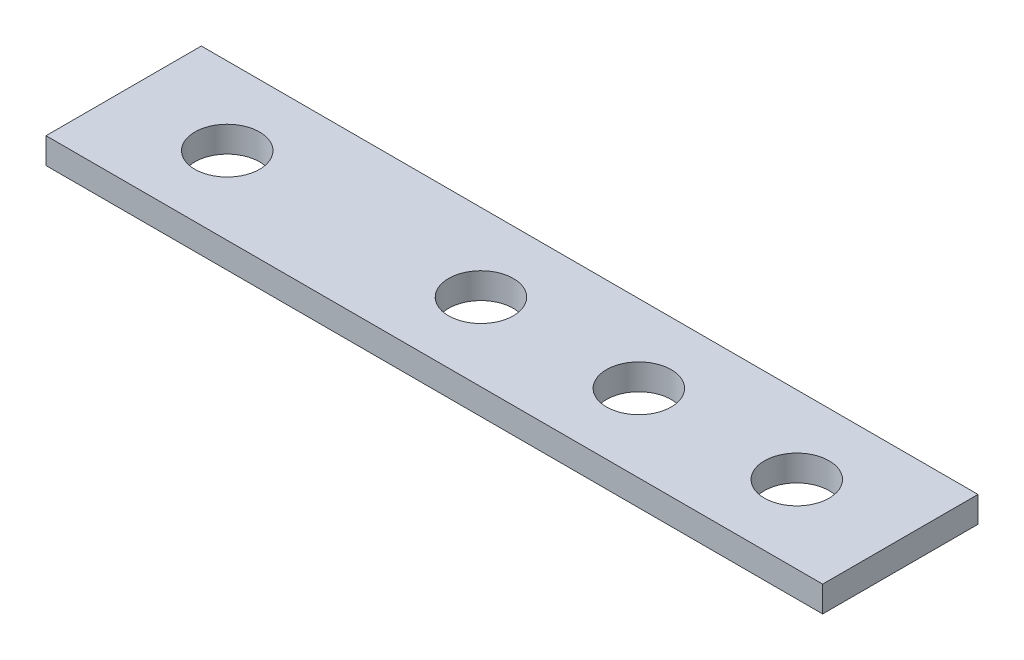
ISO-10303-21;
HEADER;
FILE_DESCRIPTION(('STEP AP214'),'2;1');
FILE_NAME('part.step','',(''),(''),'','','');
FILE_SCHEMA(('AUTOMOTIVE_DESIGN { 1 0 10303 214 1 1 1 1 }'));
ENDSEC;
DATA;
#1=APPLICATION_CONTEXT('core data for automotive mechanical design processes');
#2=APPLICATION_PROTOCOL_DEFINITION('international standard','automotive_design',2000,#1);
#3=PRODUCT_CONTEXT('',#1,'mechanical');
#4=PRODUCT('Part','Part','',(#3));
#5=PRODUCT_RELATED_PRODUCT_CATEGORY('part','',(#4));
#6=PRODUCT_DEFINITION_FORMATION('','',#4);
#7=PRODUCT_DEFINITION_CONTEXT('part definition',#1,'design');
#8=PRODUCT_DEFINITION('design','',#6,#7);
#9=PRODUCT_DEFINITION_SHAPE('','',#8);
#10=(LENGTH_UNIT() NAMED_UNIT(*) SI_UNIT(.MILLI.,.METRE.));
#11=(NAMED_UNIT(*) PLANE_ANGLE_UNIT() SI_UNIT($,.RADIAN.));
#12=(NAMED_UNIT(*) SI_UNIT($,.STERADIAN.) SOLID_ANGLE_UNIT());
#13=UNCERTAINTY_MEASURE_WITH_UNIT(LENGTH_MEASURE(1.E-05),#10,'distance_accuracy_value','');
#14=(GEOMETRIC_REPRESENTATION_CONTEXT(3) GLOBAL_UNCERTAINTY_ASSIGNED_CONTEXT((#13)) GLOBAL_UNIT_ASSIGNED_CONTEXT((#10,
#11,#12)) REPRESENTATION_CONTEXT('',''));
#15=CARTESIAN_POINT('',(0.,0.,0.));
#16=DIRECTION('',(0.,0.,1.));
#17=DIRECTION('',(1.,0.,0.));
#18=AXIS2_PLACEMENT_3D('',#15,#16,#17);
#19=CARTESIAN_POINT('',(30.,2.,6.));
#20=DIRECTION('',(-1.,0.,0.));
#21=DIRECTION('',(0.,0.,1.));
#22=AXIS2_PLACEMENT_3D('',#19,#20,#21);
#23=PLANE('',#22);
#24=DIRECTION('',(0.,0.,-1.));
#25=VECTOR('',#24,1.);
#26=CARTESIAN_POINT('',(30.,0.,6.));
#27=LINE('',#26,#25);
#28=CARTESIAN_POINT('',(30.,0.,6.));
#29=VERTEX_POINT('',#28);
#30=CARTESIAN_POINT('',(30.,0.,-6.));
#31=VERTEX_POINT('',#30);
#32=EDGE_CURVE('E96',#29,#31,#27,.T.);
#33=ORIENTED_EDGE('',*,*,#32,.T.);
#34=DIRECTION('',(0.,-1.,0.));
#35=VECTOR('',#34,1.);
#36=CARTESIAN_POINT('',(30.,2.,-6.));
#37=LINE('',#36,#35);
#38=CARTESIAN_POINT('',(30.,2.,-6.));
#39=VERTEX_POINT('',#38);
#40=EDGE_CURVE('E11',#39,#31,#37,.T.);
#41=ORIENTED_EDGE('',*,*,#40,.F.);
#42=DIRECTION('',(0.,0.,-1.));
#43=VECTOR('',#42,1.);
#44=CARTESIAN_POINT('',(30.,2.,6.));
#45=LINE('',#44,#43);
#46=CARTESIAN_POINT('',(30.,2.,6.));
#47=VERTEX_POINT('',#46);
#48=EDGE_CURVE('E84',#47,#39,#45,.T.);
#49=ORIENTED_EDGE('',*,*,#48,.F.);
#50=DIRECTION('',(0.,-1.,0.));
#51=VECTOR('',#50,1.);
#52=CARTESIAN_POINT('',(30.,2.,6.));
#53=LINE('',#52,#51);
#54=EDGE_CURVE('E92',#47,#29,#53,.T.);
#55=ORIENTED_EDGE('',*,*,#54,.T.);
#56=EDGE_LOOP('',(#33,#41,#49,#55));
#57=FACE_BOUND('',#56,.T.);
#58=ADVANCED_FACE('F33',(#57),#23,.F.);
#59=CARTESIAN_POINT('',(-30.,2.,-6.));
#60=DIRECTION('',(0.,0.,1.));
#61=DIRECTION('',(1.,0.,0.));
#62=AXIS2_PLACEMENT_3D('',#59,#60,#61);
#63=PLANE('',#62);
#64=DIRECTION('',(-1.,0.,0.));
#65=VECTOR('',#64,1.);
#66=CARTESIAN_POINT('',(-30.,0.,-6.));
#67=LINE('',#66,#65);
#68=CARTESIAN_POINT('',(-30.,0.,-6.));
#69=VERTEX_POINT('',#68);
#70=EDGE_CURVE('E88',#31,#69,#67,.T.);
#71=ORIENTED_EDGE('',*,*,#70,.T.);
#72=DIRECTION('',(0.,-1.,0.));
#73=VECTOR('',#72,1.);
#74=CARTESIAN_POINT('',(-30.,2.,-6.));
#75=LINE('',#74,#73);
#76=CARTESIAN_POINT('',(-30.,2.,-6.));
#77=VERTEX_POINT('',#76);
#78=EDGE_CURVE('E41',#77,#69,#75,.T.);
#79=ORIENTED_EDGE('',*,*,#78,.F.);
#80=DIRECTION('',(-1.,0.,0.));
#81=VECTOR('',#80,1.);
#82=CARTESIAN_POINT('',(-30.,2.,-6.));
#83=LINE('',#82,#81);
#84=EDGE_CURVE('E79',#39,#77,#83,.T.);
#85=ORIENTED_EDGE('',*,*,#84,.F.);
#86=ORIENTED_EDGE('',*,*,#40,.T.);
#87=EDGE_LOOP('',(#71,#79,#85,#86));
#88=FACE_BOUND('',#87,.T.);
#89=ADVANCED_FACE('F87',(#88),#63,.F.);
#90=CARTESIAN_POINT('',(-30.,2.,6.));
#91=DIRECTION('',(1.,0.,0.));
#92=DIRECTION('',(0.,0.,-1.));
#93=AXIS2_PLACEMENT_3D('',#90,#91,#92);
#94=PLANE('',#93);
#95=DIRECTION('',(0.,0.,1.));
#96=VECTOR('',#95,1.);
#97=CARTESIAN_POINT('',(-30.,0.,6.));
#98=LINE('',#97,#96);
#99=CARTESIAN_POINT('',(-30.,0.,6.));
#100=VERTEX_POINT('',#99);
#101=EDGE_CURVE('E66',#69,#100,#98,.T.);
#102=ORIENTED_EDGE('',*,*,#101,.T.);
#103=DIRECTION('',(0.,-1.,0.));
#104=VECTOR('',#103,1.);
#105=CARTESIAN_POINT('',(-30.,2.,6.));
#106=LINE('',#105,#104);
#107=CARTESIAN_POINT('',(-30.,2.,6.));
#108=VERTEX_POINT('',#107);
#109=EDGE_CURVE('E89',#108,#100,#106,.T.);
#110=ORIENTED_EDGE('',*,*,#109,.F.);
#111=DIRECTION('',(0.,0.,1.));
#112=VECTOR('',#111,1.);
#113=CARTESIAN_POINT('',(-30.,2.,6.));
#114=LINE('',#113,#112);
#115=EDGE_CURVE('E82',#77,#108,#114,.T.);
#116=ORIENTED_EDGE('',*,*,#115,.F.);
#117=ORIENTED_EDGE('',*,*,#78,.T.);
#118=EDGE_LOOP('',(#102,#110,#116,#117));
#119=FACE_BOUND('',#118,.T.);
#120=ADVANCED_FACE('F90',(#119),#94,.F.);
#121=CARTESIAN_POINT('',(-30.,2.,6.));
#122=DIRECTION('',(0.,0.,-1.));
#123=DIRECTION('',(-1.,0.,0.));
#124=AXIS2_PLACEMENT_3D('',#121,#122,#123);
#125=PLANE('',#124);
#126=DIRECTION('',(1.,0.,0.));
#127=VECTOR('',#126,1.);
#128=CARTESIAN_POINT('',(-30.,0.,6.));
#129=LINE('',#128,#127);
#130=EDGE_CURVE('E72',#100,#29,#129,.T.);
#131=ORIENTED_EDGE('',*,*,#130,.T.);
#132=ORIENTED_EDGE('',*,*,#54,.F.);
#133=DIRECTION('',(1.,0.,0.));
#134=VECTOR('',#133,1.);
#135=CARTESIAN_POINT('',(-30.,2.,6.));
#136=LINE('',#135,#134);
#137=EDGE_CURVE('E49',#108,#47,#136,.T.);
#138=ORIENTED_EDGE('',*,*,#137,.F.);
#139=ORIENTED_EDGE('',*,*,#109,.T.);
#140=EDGE_LOOP('',(#131,#132,#138,#139));
#141=FACE_BOUND('',#140,.T.);
#142=ADVANCED_FACE('F104',(#141),#125,.F.);
#143=CARTESIAN_POINT('',(0.,2.,0.));
#144=DIRECTION('',(0.,-1.,0.));
#145=DIRECTION('',(0.,0.,-1.));
#146=AXIS2_PLACEMENT_3D('',#143,#144,#145);
#147=PLANE('',#146);
#148=CARTESIAN_POINT('',(22.,2.,0.));
#149=DIRECTION('',(0.,1.,0.));
#150=DIRECTION('',(0.,0.,1.));
#151=AXIS2_PLACEMENT_3D('',#148,#149,#150);
#152=CIRCLE('',#151,2.49999999999999);
#153=CARTESIAN_POINT('',(22.,2.,2.49999999999999));
#154=VERTEX_POINT('',#153);
#155=EDGE_CURVE('E130',#154,#154,#152,.T.);
#156=ORIENTED_EDGE('',*,*,#155,.F.);
#157=EDGE_LOOP('',(#156));
#158=FACE_BOUND('',#157,.T.);
#159=CARTESIAN_POINT('',(9.80000000000001,2.,0.));
#160=DIRECTION('',(0.,1.,0.));
#161=DIRECTION('',(0.,0.,1.));
#162=AXIS2_PLACEMENT_3D('',#159,#160,#161);
#163=CIRCLE('',#162,2.49999999999999);
#164=CARTESIAN_POINT('',(9.80000000000001,2.,2.49999999999999));
#165=VERTEX_POINT('',#164);
#166=EDGE_CURVE('E124',#165,#165,#163,.T.);
#167=ORIENTED_EDGE('',*,*,#166,.F.);
#168=EDGE_LOOP('',(#167));
#169=FACE_BOUND('',#168,.T.);
#170=CARTESIAN_POINT('',(-2.39999999999999,2.,0.));
#171=DIRECTION('',(0.,1.,0.));
#172=DIRECTION('',(0.,0.,1.));
#173=AXIS2_PLACEMENT_3D('',#170,#171,#172);
#174=CIRCLE('',#173,2.49999999999999);
#175=CARTESIAN_POINT('',(-2.39999999999999,2.,2.49999999999999));
#176=VERTEX_POINT('',#175);
#177=EDGE_CURVE('E118',#176,#176,#174,.T.);
#178=ORIENTED_EDGE('',*,*,#177,.F.);
#179=EDGE_LOOP('',(#178));
#180=FACE_BOUND('',#179,.T.);
#181=CARTESIAN_POINT('',(-22.,2.,0.));
#182=DIRECTION('',(0.,1.,0.));
#183=DIRECTION('',(0.,0.,1.));
#184=AXIS2_PLACEMENT_3D('',#181,#182,#183);
#185=CIRCLE('',#184,2.49999999999999);
#186=CARTESIAN_POINT('',(-22.,2.,2.49999999999999));
#187=VERTEX_POINT('',#186);
#188=EDGE_CURVE('E112',#187,#187,#185,.T.);
#189=ORIENTED_EDGE('',*,*,#188,.F.);
#190=EDGE_LOOP('',(#189));
#191=FACE_BOUND('',#190,.T.);
#192=ORIENTED_EDGE('',*,*,#48,.T.);
#193=ORIENTED_EDGE('',*,*,#84,.T.);
#194=ORIENTED_EDGE('',*,*,#115,.T.);
#195=ORIENTED_EDGE('',*,*,#137,.T.);
#196=EDGE_LOOP('',(#192,#193,#194,#195));
#197=FACE_BOUND('',#196,.T.);
#198=ADVANCED_FACE('F80',(#158,#169,#180,#191,#197),#147,.F.);
#199=CARTESIAN_POINT('',(0.,0.,0.));
#200=DIRECTION('',(0.,-1.,0.));
#201=DIRECTION('',(0.,0.,-1.));
#202=AXIS2_PLACEMENT_3D('',#199,#200,#201);
#203=PLANE('',#202);
#204=CARTESIAN_POINT('',(22.,0.,0.));
#205=DIRECTION('',(0.,1.,0.));
#206=DIRECTION('',(0.,0.,1.));
#207=AXIS2_PLACEMENT_3D('',#204,#205,#206);
#208=CIRCLE('',#207,2.5);
#209=CARTESIAN_POINT('',(22.,0.,2.5));
#210=VERTEX_POINT('',#209);
#211=EDGE_CURVE('E127',#210,#210,#208,.T.);
#212=ORIENTED_EDGE('',*,*,#211,.T.);
#213=EDGE_LOOP('',(#212));
#214=FACE_BOUND('',#213,.T.);
#215=CARTESIAN_POINT('',(9.80000000000001,0.,0.));
#216=DIRECTION('',(0.,1.,0.));
#217=DIRECTION('',(0.,0.,1.));
#218=AXIS2_PLACEMENT_3D('',#215,#216,#217);
#219=CIRCLE('',#218,2.5);
#220=CARTESIAN_POINT('',(9.80000000000001,0.,2.5));
#221=VERTEX_POINT('',#220);
#222=EDGE_CURVE('E121',#221,#221,#219,.T.);
#223=ORIENTED_EDGE('',*,*,#222,.T.);
#224=EDGE_LOOP('',(#223));
#225=FACE_BOUND('',#224,.T.);
#226=CARTESIAN_POINT('',(-2.39999999999999,0.,0.));
#227=DIRECTION('',(0.,1.,0.));
#228=DIRECTION('',(0.,0.,1.));
#229=AXIS2_PLACEMENT_3D('',#226,#227,#228);
#230=CIRCLE('',#229,2.5);
#231=CARTESIAN_POINT('',(-2.39999999999999,0.,2.5));
#232=VERTEX_POINT('',#231);
#233=EDGE_CURVE('E115',#232,#232,#230,.T.);
#234=ORIENTED_EDGE('',*,*,#233,.T.);
#235=EDGE_LOOP('',(#234));
#236=FACE_BOUND('',#235,.T.);
#237=CARTESIAN_POINT('',(-22.,0.,0.));
#238=DIRECTION('',(0.,1.,0.));
#239=DIRECTION('',(0.,0.,1.));
#240=AXIS2_PLACEMENT_3D('',#237,#238,#239);
#241=CIRCLE('',#240,2.5);
#242=CARTESIAN_POINT('',(-22.,0.,2.5));
#243=VERTEX_POINT('',#242);
#244=EDGE_CURVE('E99',#243,#243,#241,.T.);
#245=ORIENTED_EDGE('',*,*,#244,.T.);
#246=EDGE_LOOP('',(#245));
#247=FACE_BOUND('',#246,.T.);
#248=ORIENTED_EDGE('',*,*,#32,.F.);
#249=ORIENTED_EDGE('',*,*,#130,.F.);
#250=ORIENTED_EDGE('',*,*,#101,.F.);
#251=ORIENTED_EDGE('',*,*,#70,.F.);
#252=EDGE_LOOP('',(#248,#249,#250,#251));
#253=FACE_BOUND('',#252,.T.);
#254=ADVANCED_FACE('F107',(#214,#225,#236,#247,#253),#203,.T.);
#255=CARTESIAN_POINT('',(-22.,2.,0.));
#256=DIRECTION('',(0.,1.,0.));
#257=DIRECTION('',(0.,0.,1.));
#258=AXIS2_PLACEMENT_3D('',#255,#256,#257);
#259=CYLINDRICAL_SURFACE('',#258,2.49999999999999);
#260=ORIENTED_EDGE('',*,*,#244,.F.);
#261=EDGE_LOOP('',(#260));
#262=FACE_BOUND('',#261,.T.);
#263=ORIENTED_EDGE('',*,*,#188,.T.);
#264=EDGE_LOOP('',(#263));
#265=FACE_BOUND('',#264,.T.);
#266=ADVANCED_FACE('F145',(#262,#265),#259,.F.);
#267=CARTESIAN_POINT('',(-2.39999999999999,2.,0.));
#268=DIRECTION('',(0.,1.,0.));
#269=DIRECTION('',(0.,0.,1.));
#270=AXIS2_PLACEMENT_3D('',#267,#268,#269);
#271=CYLINDRICAL_SURFACE('',#270,2.49999999999999);
#272=ORIENTED_EDGE('',*,*,#233,.F.);
#273=EDGE_LOOP('',(#272));
#274=FACE_BOUND('',#273,.T.);
#275=ORIENTED_EDGE('',*,*,#177,.T.);
#276=EDGE_LOOP('',(#275));
#277=FACE_BOUND('',#276,.T.);
#278=ADVANCED_FACE('F147',(#274,#277),#271,.F.);
#279=CARTESIAN_POINT('',(9.80000000000001,2.,0.));
#280=DIRECTION('',(0.,1.,0.));
#281=DIRECTION('',(0.,0.,1.));
#282=AXIS2_PLACEMENT_3D('',#279,#280,#281);
#283=CYLINDRICAL_SURFACE('',#282,2.49999999999999);
#284=ORIENTED_EDGE('',*,*,#222,.F.);
#285=EDGE_LOOP('',(#284));
#286=FACE_BOUND('',#285,.T.);
#287=ORIENTED_EDGE('',*,*,#166,.T.);
#288=EDGE_LOOP('',(#287));
#289=FACE_BOUND('',#288,.T.);
#290=ADVANCED_FACE('F154',(#286,#289),#283,.F.);
#291=CARTESIAN_POINT('',(22.,2.,0.));
#292=DIRECTION('',(0.,1.,0.));
#293=DIRECTION('',(0.,0.,1.));
#294=AXIS2_PLACEMENT_3D('',#291,#292,#293);
#295=CYLINDRICAL_SURFACE('',#294,2.49999999999999);
#296=ORIENTED_EDGE('',*,*,#211,.F.);
#297=EDGE_LOOP('',(#296));
#298=FACE_BOUND('',#297,.T.);
#299=ORIENTED_EDGE('',*,*,#155,.T.);
#300=EDGE_LOOP('',(#299));
#301=FACE_BOUND('',#300,.T.);
#302=ADVANCED_FACE('F134',(#298,#301),#295,.F.);
#303=CLOSED_SHELL('',(#58,#89,#120,#142,#198,#254,#266,#278,#290,#302));
#304=MANIFOLD_SOLID_BREP('B2',#303);
#305=ADVANCED_BREP_SHAPE_REPRESENTATION('',(#18,#304),#14);
#306=SHAPE_DEFINITION_REPRESENTATION(#9,#305);
ENDSEC;
END-ISO-10303-21;
